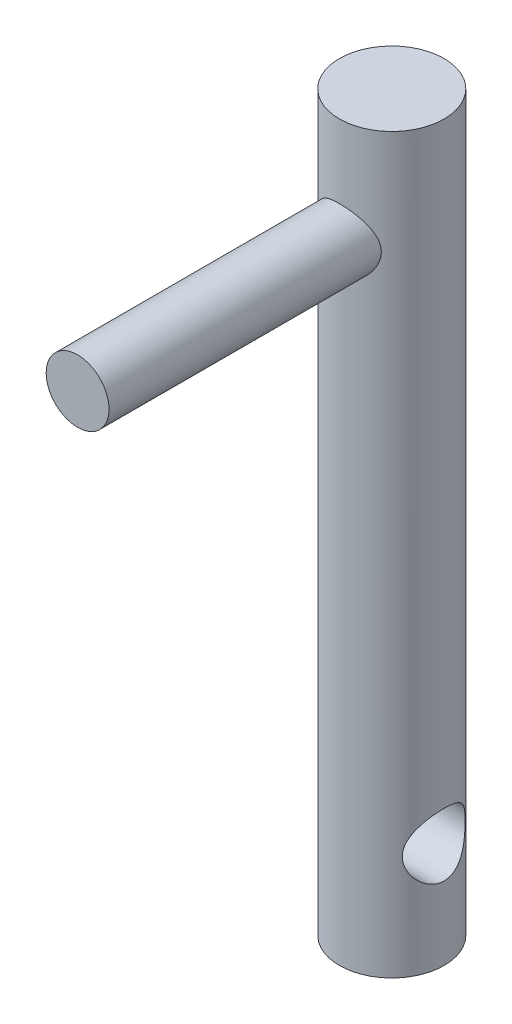
ISO-10303-21;
HEADER;
FILE_DESCRIPTION(('STEP AP214'),'2;1');
FILE_NAME('part.step','',(''),(''),'','','');
FILE_SCHEMA(('AUTOMOTIVE_DESIGN { 1 0 10303 214 1 1 1 1 }'));
ENDSEC;
DATA;
#1=APPLICATION_CONTEXT('core data for automotive mechanical design processes');
#2=APPLICATION_PROTOCOL_DEFINITION('international standard','automotive_design',2000,#1);
#3=PRODUCT_CONTEXT('',#1,'mechanical');
#4=PRODUCT('Part','Part','',(#3));
#5=PRODUCT_RELATED_PRODUCT_CATEGORY('part','',(#4));
#6=PRODUCT_DEFINITION_FORMATION('','',#4);
#7=PRODUCT_DEFINITION_CONTEXT('part definition',#1,'design');
#8=PRODUCT_DEFINITION('design','',#6,#7);
#9=PRODUCT_DEFINITION_SHAPE('','',#8);
#10=(LENGTH_UNIT() NAMED_UNIT(*) SI_UNIT(.MILLI.,.METRE.));
#11=(NAMED_UNIT(*) PLANE_ANGLE_UNIT() SI_UNIT($,.RADIAN.));
#12=(NAMED_UNIT(*) SI_UNIT($,.STERADIAN.) SOLID_ANGLE_UNIT());
#13=UNCERTAINTY_MEASURE_WITH_UNIT(LENGTH_MEASURE(1.E-05),#10,'distance_accuracy_value','');
#14=(GEOMETRIC_REPRESENTATION_CONTEXT(3) GLOBAL_UNCERTAINTY_ASSIGNED_CONTEXT((#13)) GLOBAL_UNIT_ASSIGNED_CONTEXT((#10,
#11,#12)) REPRESENTATION_CONTEXT('',''));
#15=CARTESIAN_POINT('',(0.,0.,0.));
#16=DIRECTION('',(0.,0.,1.));
#17=DIRECTION('',(1.,0.,0.));
#18=AXIS2_PLACEMENT_3D('',#15,#16,#17);
#19=CARTESIAN_POINT('',(0.,35.,0.));
#20=DIRECTION('',(0.,-1.,0.));
#21=DIRECTION('',(0.,0.,-1.));
#22=AXIS2_PLACEMENT_3D('',#19,#20,#21);
#23=CYLINDRICAL_SURFACE('',#22,2.5);
#24=CARTESIAN_POINT('',(-2.5,3.5,0.));
#25=CARTESIAN_POINT('',(-2.49999625789732,3.50000409100988,-0.0767298334620158));
#26=CARTESIAN_POINT('',(-2.4964290461501,3.50592867092626,-0.153582320644178));
#27=CARTESIAN_POINT('',(-2.48249903608568,3.52932431951533,-0.304975509530679));
#28=CARTESIAN_POINT('',(-2.47211948032719,3.54682386185422,-0.379510034596047));
#29=CARTESIAN_POINT('',(-2.44561558054488,3.59238636116686,-0.523751827790837));
#30=CARTESIAN_POINT('',(-2.42951973272944,3.62039695816316,-0.593481028226566));
#31=CARTESIAN_POINT('',(-2.39295367626407,3.68586033314103,-0.727030318214659));
#32=CARTESIAN_POINT('',(-2.37248455380255,3.72331076696875,-0.790851869416383));
#33=CARTESIAN_POINT('',(-2.32705360719088,3.80977482670858,-0.916299278999315));
#34=CARTESIAN_POINT('',(-2.30186792195985,3.85945369535139,-0.977384020081415));
#35=CARTESIAN_POINT('',(-2.25030439279634,3.96746720382827,-1.09088270411891));
#36=CARTESIAN_POINT('',(-2.22392505153571,4.02581293718732,-1.14328534948112));
#37=CARTESIAN_POINT('',(-2.1691106699591,4.15792351049673,-1.24444996762974));
#38=CARTESIAN_POINT('',(-2.14082017703649,4.23270177098129,-1.29197766378809));
#39=CARTESIAN_POINT('',(-2.08938301412124,4.39084657324312,-1.37361437764896));
#40=CARTESIAN_POINT('',(-2.06622802273938,4.47419889624757,-1.4077451733516));
#41=CARTESIAN_POINT('',(-2.0335462966093,4.62659645065324,-1.45440601714222));
#42=CARTESIAN_POINT('',(-2.02207883137591,4.69423599861032,-1.47016197246826));
#43=CARTESIAN_POINT('',(-2.00590308295503,4.83180371583036,-1.49216172340475));
#44=CARTESIAN_POINT('',(-2.00118639643759,4.90172892875449,-1.49841734556836));
#45=CARTESIAN_POINT('',(-1.99920922463856,5.04201149421734,-1.50105508796009));
#46=CARTESIAN_POINT('',(-2.00196337012718,5.1123694250932,-1.49741783408419));
#47=CARTESIAN_POINT('',(-2.01453261443741,5.25127877542759,-1.48046060478828));
#48=CARTESIAN_POINT('',(-2.02435302432226,5.31982879584745,-1.46713334620103));
#49=CARTESIAN_POINT('',(-2.04953186944258,5.45253024212811,-1.43173921881792));
#50=CARTESIAN_POINT('',(-2.06481711652537,5.51672705392448,-1.40978748666087));
#51=CARTESIAN_POINT('',(-2.09927051350828,5.64069499092812,-1.35795061770837));
#52=CARTESIAN_POINT('',(-2.11844008623465,5.70046448342393,-1.32806257259705));
#53=CARTESIAN_POINT('',(-2.16255327268985,5.8249840971228,-1.25517983184583));
#54=CARTESIAN_POINT('',(-2.18792043372992,5.88877809295493,-1.21080724397723));
#55=CARTESIAN_POINT('',(-2.23930599764381,6.00867648366702,-1.11291092784003));
#56=CARTESIAN_POINT('',(-2.26532500262149,6.06477343397651,-1.05937845100579));
#57=CARTESIAN_POINT('',(-2.31935504958317,6.17561298182176,-0.935811834382965));
#58=CARTESIAN_POINT('',(-2.34713836268532,6.22907730601599,-0.864517682704956));
#59=CARTESIAN_POINT('',(-2.39772428433981,6.32312204719791,-0.712276050458999));
#60=CARTESIAN_POINT('',(-2.42052955425515,6.36370935378995,-0.631333763943563));
#61=CARTESIAN_POINT('',(-2.45730392066151,6.4279321827959,-0.467197585268205));
#62=CARTESIAN_POINT('',(-2.47173957439704,6.45247535571591,-0.384467624173579));
#63=CARTESIAN_POINT('',(-2.49218842813551,6.48701119740538,-0.215047895144638));
#64=CARTESIAN_POINT('',(-2.49821172952738,6.49702131775358,-0.128363005661318));
#65=CARTESIAN_POINT('',(-2.5009057037461,6.50150784767831,0.0337146143773968));
#66=CARTESIAN_POINT('',(-2.49873521714286,6.49790885508517,0.109042473418718));
#67=CARTESIAN_POINT('',(-2.48778712087048,6.47957414692808,0.257829401986061));
#68=CARTESIAN_POINT('',(-2.47900964518037,6.46483865719419,0.331288509376106));
#69=CARTESIAN_POINT('',(-2.4559479244219,6.42545656718754,0.472574932157613));
#70=CARTESIAN_POINT('',(-2.44180275662555,6.40105965092653,0.540495750928484));
#71=CARTESIAN_POINT('',(-2.40913880862844,6.34332262363473,0.671265749087263));
#72=CARTESIAN_POINT('',(-2.39061916586511,6.30998074865333,0.734113924963909));
#73=CARTESIAN_POINT('',(-2.3484549623736,6.23144302079129,0.860006262823864));
#74=CARTESIAN_POINT('',(-2.3244780273988,6.18537617092161,0.922394150456837));
#75=CARTESIAN_POINT('',(-2.27474265574732,6.08460860651138,1.03902603131014));
#76=CARTESIAN_POINT('',(-2.2489821658636,6.02989784514746,1.09326040273738));
#77=CARTESIAN_POINT('',(-2.19445423909891,5.90508960996285,1.19931996735579));
#78=CARTESIAN_POINT('',(-2.16573241746291,5.8339161145345,1.24991019630915));
#79=CARTESIAN_POINT('',(-2.1121618206671,5.68278397543179,1.33845238915668));
#80=CARTESIAN_POINT('',(-2.0873089799769,5.60283470610721,1.37641766769781));
#81=CARTESIAN_POINT('',(-2.04984909240519,5.45375697769331,1.43142578795776));
#82=CARTESIAN_POINT('',(-2.03575659328729,5.38601968764141,1.4512162533619));
#83=CARTESIAN_POINT('',(-2.01409605743544,5.2474679219199,1.48113663905972));
#84=CARTESIAN_POINT('',(-2.00651897642721,5.17665785567217,1.49127995297631));
#85=CARTESIAN_POINT('',(-1.99900446616268,5.03362305240297,1.50134130416631));
#86=CARTESIAN_POINT('',(-1.99909576445937,4.96139400931296,1.50122089107869));
#87=CARTESIAN_POINT('',(-2.0069771789285,4.81810556439054,1.49066472959328));
#88=CARTESIAN_POINT('',(-2.0147714813882,4.7470468199194,1.48022337215759));
#89=CARTESIAN_POINT('',(-2.0363318524298,4.61151158242781,1.45040174148913));
#90=CARTESIAN_POINT('',(-2.0497921180558,4.54688290569313,1.43147636845351));
#91=CARTESIAN_POINT('',(-2.08105501960151,4.42166274552578,1.38563242076993));
#92=CARTESIAN_POINT('',(-2.09885929040482,4.36107279303945,1.35871083588479));
#93=CARTESIAN_POINT('',(-2.14012990550917,4.23568014277922,1.29289245555732));
#94=CARTESIAN_POINT('',(-2.16404587582639,4.17165889614569,1.25279167675753));
#95=CARTESIAN_POINT('',(-2.21320127030768,4.05061992738271,1.16375698389084));
#96=CARTESIAN_POINT('',(-2.23844177205021,3.99360803784744,1.11481579607798));
#97=CARTESIAN_POINT('',(-2.29225690291476,3.87864905086833,1.00009777425734));
#98=CARTESIAN_POINT('',(-2.32070308663658,3.82206892510381,0.932876819313904));
#99=CARTESIAN_POINT('',(-2.37365428872367,3.72090214413669,0.788462434445588));
#100=CARTESIAN_POINT('',(-2.39815789310936,3.67631978801521,0.711265444501539));
#101=CARTESIAN_POINT('',(-2.43985578654394,3.60221419242626,0.551125230801453));
#102=CARTESIAN_POINT('',(-2.45725077479787,3.57227193507317,0.468430086957214));
#103=CARTESIAN_POINT('',(-2.48366273001246,3.52727530478903,0.297973306118807));
#104=CARTESIAN_POINT('',(-2.49271125871485,3.51216483214301,0.210232099648612));
#105=CARTESIAN_POINT('',(-2.49802001168187,3.50330254529134,0.101558096917536));
#106=CARTESIAN_POINT('',(-2.49876114656362,3.5020655826939,0.0812762590282773));
#107=CARTESIAN_POINT('',(-2.49975164517367,3.50041375362914,0.0406658206871126));
#108=CARTESIAN_POINT('',(-2.50000099184316,3.4999989156791,0.0203372186375696));
#109=CARTESIAN_POINT('',(-2.5,3.5,0.));
#110=B_SPLINE_CURVE_WITH_KNOTS('',3,(#24,#25,#26,#27,#28,#29,#30,#31,#32,#33,#34,#35,#36,#37,
#38,#39,#40,#41,#42,#43,#44,#45,#46,#47,#48,#49,#50,#51,#52,#53,#54,#55,#56,#57,#58,#59,#60,#61,
#62,#63,#64,#65,#66,#67,#68,#69,#70,#71,#72,#73,#74,#75,#76,#77,#78,#79,#80,#81,#82,#83,#84,#85,
#86,#87,#88,#89,#90,#91,#92,#93,#94,#95,#96,#97,#98,#99,#100,#101,#102,#103,#104,#105,#106,#107,
#108,#109),.UNSPECIFIED.,.T.,.F.,(4,2,2,2,2,2,2,2,2,2,2,2,2,2,2,2,2,2,2,2,2,2,2,2,2,2,2,2,2,2,2,
2,2,2,2,2,2,2,2,2,2,2,4),(0.,0.230102237548649,0.460772627520012,0.690308884600012,
0.919788197992275,1.16681590732473,1.41416257934801,1.69183813189807,1.96906040692092,
2.17933829855633,2.38935420916578,2.59978170870726,2.81036753273872,3.01823267593207,
3.22617409809868,3.47046995225163,3.71500044803674,3.99360957884691,4.27206939275324,
4.5329679069656,4.79355286918236,5.01875602722426,5.24395461863455,5.46367785689772,
5.68344445659025,5.92601365818362,6.16886690081836,6.44336762428009,6.71757792616456,
6.93257787314692,7.14727888733319,7.36278425777433,7.57840681155725,7.78364098331142,
7.98895251523035,8.22578610052286,8.46281544370208,8.73854311775519,9.01436946031985,
9.28175654462677,9.54812832184448,9.60911473335177,9.6701032602764),.UNSPECIFIED.);
#111=CARTESIAN_POINT('',(-2.5,3.5,0.));
#112=VERTEX_POINT('',#111);
#113=EDGE_CURVE('E43',#112,#112,#110,.T.);
#114=ORIENTED_EDGE('',*,*,#113,.T.);
#115=EDGE_LOOP('',(#114));
#116=FACE_BOUND('',#115,.T.);
#117=CARTESIAN_POINT('',(2.,5.,-1.5));
#118=CARTESIAN_POINT('',(1.99999416642511,4.92452102471036,-1.50000404108592));
#119=CARTESIAN_POINT('',(2.00433633903481,4.8490615659202,-1.49426852824014));
#120=CARTESIAN_POINT('',(2.02092590613883,4.70067609603778,-1.47174965152787));
#121=CARTESIAN_POINT('',(2.03318155043097,4.6277528126149,-1.45495475788936));
#122=CARTESIAN_POINT('',(2.0636233903473,4.48691635832272,-1.41143486335795));
#123=CARTESIAN_POINT('',(2.0817666618312,4.41897116196473,-1.3847815450315));
#124=CARTESIAN_POINT('',(2.12185904995836,4.28856254663208,-1.32252909283019));
#125=CARTESIAN_POINT('',(2.14380930122416,4.22610077030486,-1.28692729054693));
#126=CARTESIAN_POINT('',(2.19228594587542,4.10005098333592,-1.20271292747644));
#127=CARTESIAN_POINT('',(2.21904371037662,4.03725904287606,-1.15304179435289));
#128=CARTESIAN_POINT('',(2.27226229431061,3.92023523725825,-1.04426801309985));
#129=CARTESIAN_POINT('',(2.29872287517103,3.8660098483292,-0.985158296729614));
#130=CARTESIAN_POINT('',(2.35175567858734,3.7618661902903,-0.851442367411702));
#131=CARTESIAN_POINT('',(2.37803133577818,3.71304553633025,-0.775851995162549));
#132=CARTESIAN_POINT('',(2.42443786983179,3.62919027755557,-0.615654228271659));
#133=CARTESIAN_POINT('',(2.44457437988735,3.59414302587729,-0.531055196626331));
#134=CARTESIAN_POINT('',(2.4747098780044,3.54240407718735,-0.363771406742667));
#135=CARTESIAN_POINT('',(2.4854930393917,3.5242796390327,-0.281674698130916));
#136=CARTESIAN_POINT('',(2.49874939277545,3.50205719713688,-0.114970509382709));
#137=CARTESIAN_POINT('',(2.50123038813308,3.49794602199995,-0.030365462400154));
#138=CARTESIAN_POINT('',(2.49783372711539,3.50361374734246,0.127637283737309));
#139=CARTESIAN_POINT('',(2.49295437513726,3.51173352616931,0.201123832865634));
#140=CARTESIAN_POINT('',(2.47707997553857,3.53847979564811,0.345464269151767));
#141=CARTESIAN_POINT('',(2.46608447529309,3.55710706390715,0.416317961051201));
#142=CARTESIAN_POINT('',(2.43884907201719,3.60416556270378,0.554056780469079));
#143=CARTESIAN_POINT('',(2.42257910450824,3.632653061139,0.620916491037617));
#144=CARTESIAN_POINT('',(2.38609637638748,3.69838461622554,0.748988660115611));
#145=CARTESIAN_POINT('',(2.36588259201812,3.73563094705901,0.810199646208011));
#146=CARTESIAN_POINT('',(2.32037925976363,3.82283909280445,0.933074267143199));
#147=CARTESIAN_POINT('',(2.2947718295215,3.87378831173574,0.993918663198193));
#148=CARTESIAN_POINT('',(2.24255554245601,3.98440411786018,1.10671465909275));
#149=CARTESIAN_POINT('',(2.21594536703375,4.04408250347451,1.1586540130834));
#150=CARTESIAN_POINT('',(2.16111075123946,4.17865340616355,1.25824837767417));
#151=CARTESIAN_POINT('',(2.13305661385124,4.25450757653946,1.30470933188632));
#152=CARTESIAN_POINT('',(2.08250879557267,4.41470623163661,1.38397217194232));
#153=CARTESIAN_POINT('',(2.0600049029882,4.49903471612564,1.41679921962189));
#154=CARTESIAN_POINT('',(2.02895865196731,4.65239363189535,1.46077497064842));
#155=CARTESIAN_POINT('',(2.01833888618315,4.72004063229664,1.47527903312665));
#156=CARTESIAN_POINT('',(2.00392150777558,4.85737361029948,1.49480872755284));
#157=CARTESIAN_POINT('',(2.00011596115116,4.92705712048456,1.49984538302907));
#158=CARTESIAN_POINT('',(1.99988914321323,5.06655168243571,1.50014781114183));
#159=CARTESIAN_POINT('',(2.00347810223984,5.13636277721521,1.49540004697659));
#160=CARTESIAN_POINT('',(2.01751520788652,5.27398734374856,1.47640290574941));
#161=CARTESIAN_POINT('',(2.02796877613213,5.34179919224026,1.46214601830139));
#162=CARTESIAN_POINT('',(2.054317683331,5.47371457947979,1.42488312618657));
#163=CARTESIAN_POINT('',(2.07020622092812,5.53782263653223,1.40188805257362));
#164=CARTESIAN_POINT('',(2.10571539417587,5.66147771573018,1.34796261057072));
#165=CARTESIAN_POINT('',(2.12533743689999,5.721023006366,1.31702924888212));
#166=CARTESIAN_POINT('',(2.17036819177737,5.84524008251225,1.24167439558512));
#167=CARTESIAN_POINT('',(2.19618239397369,5.90890083509657,1.19582663060303));
#168=CARTESIAN_POINT('',(2.2482175480362,6.02828548484946,1.09487395518701));
#169=CARTESIAN_POINT('',(2.27443886711455,6.08400169216912,1.03976018672402));
#170=CARTESIAN_POINT('',(2.32835625910913,6.19322400735043,0.913274837212767));
#171=CARTESIAN_POINT('',(2.3558007587587,6.24550072660584,0.840721108780192));
#172=CARTESIAN_POINT('',(2.40537639133459,6.33690277683665,0.68610310086802));
#173=CARTESIAN_POINT('',(2.42751104449411,6.37603682784092,0.604045176134703));
#174=CARTESIAN_POINT('',(2.46252280092775,6.43686820343137,0.438840232972138));
#175=CARTESIAN_POINT('',(2.47595588067329,6.45962622779111,0.356205963651258));
#176=CARTESIAN_POINT('',(2.494407389061,6.49071460284626,0.187383063890857));
#177=CARTESIAN_POINT('',(2.49943534582737,6.49906129071762,0.101198571781968));
#178=CARTESIAN_POINT('',(2.50040600461976,6.50067460858593,-0.0598120232009845));
#179=CARTESIAN_POINT('',(2.49747057186327,6.49580333456303,-0.134620583589707));
#180=CARTESIAN_POINT('',(2.48512948412095,6.47510617561839,-0.282148755978774));
#181=CARTESIAN_POINT('',(2.47572375706639,6.4592801686784,-0.354868344701914));
#182=CARTESIAN_POINT('',(2.45149427526962,6.41778042841621,-0.495145481978797));
#183=CARTESIAN_POINT('',(2.43675966858906,6.39226840387076,-0.562767032608831));
#184=CARTESIAN_POINT('',(2.40303337447155,6.33235940544525,-0.692781971999984));
#185=CARTESIAN_POINT('',(2.38404073252268,6.2979604391404,-0.755174184199833));
#186=CARTESIAN_POINT('',(2.34093432659381,6.21707480343124,-0.880263645295948));
#187=CARTESIAN_POINT('',(2.31648844639149,6.16968129098313,-0.94225869043994));
#188=CARTESIAN_POINT('',(2.26601907350661,6.06624696628228,-1.05789751536307));
#189=CARTESIAN_POINT('',(2.23999385274509,6.01019657439209,-1.11153190956916));
#190=CARTESIAN_POINT('',(2.18528165666204,5.8827144378223,-1.2159097535057));
#191=CARTESIAN_POINT('',(2.15667566270901,5.8102335138345,-1.26542406663368));
#192=CARTESIAN_POINT('',(2.10376464485145,5.65651514723346,-1.35156817210325));
#193=CARTESIAN_POINT('',(2.07945738811052,5.57528228601859,-1.38820466322661));
#194=CARTESIAN_POINT('',(2.0408000304796,5.4129357148628,-1.44437116535132));
#195=CARTESIAN_POINT('',(2.02577665830138,5.33240476403875,-1.46509526060187));
#196=CARTESIAN_POINT('',(2.00539032320036,5.16790260529632,-1.49289268240426));
#197=CARTESIAN_POINT('',(2.00000648744643,5.08393923424129,-1.49999550595837));
#198=CARTESIAN_POINT('',(2.,5.,-1.5));
#199=B_SPLINE_CURVE_WITH_KNOTS('',3,(#117,#118,#119,#120,#121,#122,#123,#124,#125,#126,#127,
#128,#129,#130,#131,#132,#133,#134,#135,#136,#137,#138,#139,#140,#141,#142,#143,#144,#145,#146,
#147,#148,#149,#150,#151,#152,#153,#154,#155,#156,#157,#158,#159,#160,#161,#162,#163,#164,#165,
#166,#167,#168,#169,#170,#171,#172,#173,#174,#175,#176,#177,#178,#179,#180,#181,#182,#183,#184,
#185,#186,#187,#188,#189,#190,#191,#192,#193,#194,#195,#196,#197,#198),.UNSPECIFIED.,.T.,.F.,(4,
2,2,2,2,2,2,2,2,2,2,2,2,2,2,2,2,2,2,2,2,2,2,2,2,2,2,2,2,2,2,2,2,2,2,2,2,2,2,2,4),(0.,
0.226085249493392,0.45240657433077,0.677113624991875,0.901887762215931,1.15414462390001,
1.40659128601844,1.68630157736223,1.9657544327122,2.21853330858497,2.47107452602766,
2.69230130543181,2.91354445887944,3.13607155036377,3.35865648368878,3.60782810055849,
3.85733966656908,4.13576671140276,4.41367760154768,4.62276298054684,4.83160475643976,
5.04073566011181,5.25003193304128,5.45906724365495,5.66818149154661,5.91499438482002,
6.16204457978454,6.44121828011588,6.72020638384847,6.97891479383337,7.23732973022726,
7.46129321849399,7.68525920139648,7.90563970188756,8.12606965394584,8.37042963549487,
8.61506198741955,8.89071695766604,9.16622832484805,9.41820120134354,9.66962780912277),.UNSPECIFIED.);
#200=CARTESIAN_POINT('',(2.,5.,-1.5));
#201=VERTEX_POINT('',#200);
#202=EDGE_CURVE('E47',#201,#201,#199,.T.);
#203=ORIENTED_EDGE('',*,*,#202,.T.);
#204=EDGE_LOOP('',(#203));
#205=FACE_BOUND('',#204,.T.);
#206=CARTESIAN_POINT('',(0.,35.,0.));
#207=DIRECTION('',(0.,1.,0.));
#208=DIRECTION('',(0.,0.,1.));
#209=AXIS2_PLACEMENT_3D('',#206,#207,#208);
#210=CIRCLE('',#209,2.5);
#211=CARTESIAN_POINT('',(0.,35.,2.5));
#212=VERTEX_POINT('',#211);
#213=EDGE_CURVE('E51',#212,#212,#210,.T.);
#214=ORIENTED_EDGE('',*,*,#213,.F.);
#215=EDGE_LOOP('',(#214));
#216=FACE_BOUND('',#215,.T.);
#217=CARTESIAN_POINT('',(0.,0.,0.));
#218=DIRECTION('',(0.,1.,0.));
#219=DIRECTION('',(0.,0.,1.));
#220=AXIS2_PLACEMENT_3D('',#217,#218,#219);
#221=CIRCLE('',#220,2.5);
#222=CARTESIAN_POINT('',(0.,0.,2.5));
#223=VERTEX_POINT('',#222);
#224=EDGE_CURVE('E90',#223,#223,#221,.T.);
#225=ORIENTED_EDGE('',*,*,#224,.T.);
#226=EDGE_LOOP('',(#225));
#227=FACE_BOUND('',#226,.T.);
#228=CARTESIAN_POINT('',(-1.5,30.,2.));
#229=CARTESIAN_POINT('',(-1.50000404108592,29.9245210247104,1.99999416642511));
#230=CARTESIAN_POINT('',(-1.49426852824014,29.8490615659202,2.00433633903481));
#231=CARTESIAN_POINT('',(-1.47174965152788,29.7006760960378,2.02092590613883));
#232=CARTESIAN_POINT('',(-1.45495475788936,29.6277528126149,2.03318155043097));
#233=CARTESIAN_POINT('',(-1.41143486335796,29.4869163583227,2.0636233903473));
#234=CARTESIAN_POINT('',(-1.3847815450315,29.4189711619647,2.08176666183119));
#235=CARTESIAN_POINT('',(-1.3225290928302,29.2885625466321,2.12185904995836));
#236=CARTESIAN_POINT('',(-1.28692729054694,29.2261007703049,2.14380930122416));
#237=CARTESIAN_POINT('',(-1.20271292747644,29.1000509833359,2.19228594587542));
#238=CARTESIAN_POINT('',(-1.15304179435289,29.0372590428761,2.21904371037662));
#239=CARTESIAN_POINT('',(-1.04426801309985,28.9202352372583,2.2722622943106));
#240=CARTESIAN_POINT('',(-0.985158296729614,28.8660098483292,2.29872287517103));
#241=CARTESIAN_POINT('',(-0.851442367411702,28.7618661902903,2.35175567858734));
#242=CARTESIAN_POINT('',(-0.775851995162549,28.7130455363302,2.37803133577818));
#243=CARTESIAN_POINT('',(-0.615654228271659,28.6291902775556,2.42443786983179));
#244=CARTESIAN_POINT('',(-0.53105519662633,28.5941430258773,2.44457437988735));
#245=CARTESIAN_POINT('',(-0.363771406742665,28.5424040771873,2.4747098780044));
#246=CARTESIAN_POINT('',(-0.281674698130914,28.5242796390327,2.4854930393917));
#247=CARTESIAN_POINT('',(-0.114970509382707,28.5020571971369,2.49874939277545));
#248=CARTESIAN_POINT('',(-0.0303654624001526,28.4979460219999,2.50123038813307));
#249=CARTESIAN_POINT('',(0.12763728373731,28.5036137473425,2.49783372711539));
#250=CARTESIAN_POINT('',(0.201123832865635,28.5117335261693,2.49295437513726));
#251=CARTESIAN_POINT('',(0.345464269151768,28.5384797956481,2.47707997553857));
#252=CARTESIAN_POINT('',(0.416317961051202,28.5571070639072,2.46608447529309));
#253=CARTESIAN_POINT('',(0.55405678046908,28.6041655627038,2.43884907201719));
#254=CARTESIAN_POINT('',(0.620916491037618,28.632653061139,2.42257910450824));
#255=CARTESIAN_POINT('',(0.748988660115612,28.6983846162255,2.38609637638748));
#256=CARTESIAN_POINT('',(0.810199646208012,28.735630947059,2.36588259201812));
#257=CARTESIAN_POINT('',(0.933074267143201,28.8228390928045,2.32037925976362));
#258=CARTESIAN_POINT('',(0.993918663198194,28.8737883117357,2.2947718295215));
#259=CARTESIAN_POINT('',(1.10671465909275,28.9844041178602,2.24255554245601));
#260=CARTESIAN_POINT('',(1.1586540130834,29.0440825034745,2.21594536703375));
#261=CARTESIAN_POINT('',(1.25824837767417,29.1786534061636,2.16111075123945));
#262=CARTESIAN_POINT('',(1.30470933188632,29.2545075765395,2.13305661385124));
#263=CARTESIAN_POINT('',(1.38397217194232,29.4147062316366,2.08250879557267));
#264=CARTESIAN_POINT('',(1.41679921962189,29.4990347161256,2.0600049029882));
#265=CARTESIAN_POINT('',(1.46077497064843,29.6523936318954,2.02895865196731));
#266=CARTESIAN_POINT('',(1.47527903312665,29.7200406322966,2.01833888618315));
#267=CARTESIAN_POINT('',(1.49480872755284,29.8573736102995,2.00392150777558));
#268=CARTESIAN_POINT('',(1.49984538302907,29.9270571204846,2.00011596115116));
#269=CARTESIAN_POINT('',(1.50014781114183,30.0665516824357,1.99988914321323));
#270=CARTESIAN_POINT('',(1.49540004697659,30.1363627772152,2.00347810223984));
#271=CARTESIAN_POINT('',(1.47640290574941,30.2739873437486,2.01751520788652));
#272=CARTESIAN_POINT('',(1.4621460183014,30.3417991922403,2.02796877613213));
#273=CARTESIAN_POINT('',(1.42488312618657,30.4737145794798,2.054317683331));
#274=CARTESIAN_POINT('',(1.40188805257362,30.5378226365322,2.07020622092812));
#275=CARTESIAN_POINT('',(1.34796261057072,30.6614777157302,2.10571539417587));
#276=CARTESIAN_POINT('',(1.31702924888212,30.721023006366,2.12533743689999));
#277=CARTESIAN_POINT('',(1.24167439558512,30.8452400825123,2.17036819177737));
#278=CARTESIAN_POINT('',(1.19582663060302,30.9089008350966,2.19618239397369));
#279=CARTESIAN_POINT('',(1.09487395518701,31.0282854848495,2.24821754803621));
#280=CARTESIAN_POINT('',(1.03976018672402,31.0840016921691,2.27443886711455));
#281=CARTESIAN_POINT('',(0.913274837212766,31.1932240073504,2.32835625910913));
#282=CARTESIAN_POINT('',(0.84072110878019,31.2455007266058,2.3558007587587));
#283=CARTESIAN_POINT('',(0.686103100868017,31.3369027768367,2.40537639133459));
#284=CARTESIAN_POINT('',(0.6040451761347,31.3760368278409,2.42751104449411));
#285=CARTESIAN_POINT('',(0.438840232972136,31.4368682034314,2.46252280092775));
#286=CARTESIAN_POINT('',(0.356205963651256,31.4596262277911,2.47595588067329));
#287=CARTESIAN_POINT('',(0.187383063890855,31.4907146028463,2.494407389061));
#288=CARTESIAN_POINT('',(0.101198571781966,31.4990612907176,2.49943534582737));
#289=CARTESIAN_POINT('',(-0.0598120232009864,31.5006746085859,2.50040600461976));
#290=CARTESIAN_POINT('',(-0.134620583589708,31.495803334563,2.49747057186327));
#291=CARTESIAN_POINT('',(-0.282148755978776,31.4751061756184,2.48512948412095));
#292=CARTESIAN_POINT('',(-0.354868344701917,31.4592801686784,2.47572375706639));
#293=CARTESIAN_POINT('',(-0.4951454819788,31.4177804284162,2.45149427526962));
#294=CARTESIAN_POINT('',(-0.562767032608834,31.3922684038708,2.43675966858906));
#295=CARTESIAN_POINT('',(-0.692781971999989,31.3323594054452,2.40303337447155));
#296=CARTESIAN_POINT('',(-0.755174184199837,31.2979604391404,2.38404073252268));
#297=CARTESIAN_POINT('',(-0.880263645295951,31.2170748034312,2.3409343265938));
#298=CARTESIAN_POINT('',(-0.942258690439942,31.1696812909831,2.31648844639149));
#299=CARTESIAN_POINT('',(-1.05789751536307,31.0662469662823,2.26601907350661));
#300=CARTESIAN_POINT('',(-1.11153190956916,31.0101965743921,2.23999385274509));
#301=CARTESIAN_POINT('',(-1.2159097535057,30.8827144378223,2.18528165666204));
#302=CARTESIAN_POINT('',(-1.26542406663368,30.8102335138345,2.15667566270901));
#303=CARTESIAN_POINT('',(-1.35156817210325,30.6565151472335,2.10376464485145));
#304=CARTESIAN_POINT('',(-1.38820466322661,30.5752822860186,2.07945738811052));
#305=CARTESIAN_POINT('',(-1.44437116535132,30.4129357148628,2.0408000304796));
#306=CARTESIAN_POINT('',(-1.46509526060188,30.3324047640388,2.02577665830138));
#307=CARTESIAN_POINT('',(-1.49289268240427,30.1679026052963,2.00539032320036));
#308=CARTESIAN_POINT('',(-1.49999550595837,30.0839392342413,2.00000648744643));
#309=CARTESIAN_POINT('',(-1.5,30.,2.));
#310=B_SPLINE_CURVE_WITH_KNOTS('',3,(#228,#229,#230,#231,#232,#233,#234,#235,#236,#237,#238,
#239,#240,#241,#242,#243,#244,#245,#246,#247,#248,#249,#250,#251,#252,#253,#254,#255,#256,#257,
#258,#259,#260,#261,#262,#263,#264,#265,#266,#267,#268,#269,#270,#271,#272,#273,#274,#275,#276,
#277,#278,#279,#280,#281,#282,#283,#284,#285,#286,#287,#288,#289,#290,#291,#292,#293,#294,#295,
#296,#297,#298,#299,#300,#301,#302,#303,#304,#305,#306,#307,#308,#309),.UNSPECIFIED.,.T.,.F.,(4,
2,2,2,2,2,2,2,2,2,2,2,2,2,2,2,2,2,2,2,2,2,2,2,2,2,2,2,2,2,2,2,2,2,2,2,2,2,2,2,4),(0.,
0.22608524949339,0.452406574330771,0.677113624991876,0.90188776221593,1.15414462390001,
1.40659128601844,1.68630157736223,1.9657544327122,2.21853330858498,2.47107452602767,
2.69230130543182,2.91354445887945,3.13607155036377,3.35865648368879,3.60782810055849,
3.85733966656909,4.13576671140277,4.41367760154769,4.62276298054685,4.83160475643977,
5.04073566011182,5.25003193304129,5.45906724365496,5.66818149154662,5.91499438482003,
6.16204457978455,6.4412182801159,6.72020638384849,6.97891479383338,7.23732973022727,
7.461293218494,7.68525920139649,7.90563970188757,8.12606965394586,8.37042963549488,
8.61506198741956,8.89071695766605,9.16622832484807,9.41820120134355,9.66962780912278),.UNSPECIFIED.);
#311=CARTESIAN_POINT('',(-1.5,30.,2.));
#312=VERTEX_POINT('',#311);
#313=EDGE_CURVE('E10',#312,#312,#310,.T.);
#314=ORIENTED_EDGE('',*,*,#313,.F.);
#315=EDGE_LOOP('',(#314));
#316=FACE_BOUND('',#315,.T.);
#317=ADVANCED_FACE('F32',(#116,#205,#216,#227,#316),#23,.T.);
#318=CARTESIAN_POINT('',(0.,35.,0.));
#319=DIRECTION('',(0.,1.,0.));
#320=DIRECTION('',(0.,0.,1.));
#321=AXIS2_PLACEMENT_3D('',#318,#319,#320);
#322=PLANE('',#321);
#323=ORIENTED_EDGE('',*,*,#213,.T.);
#324=EDGE_LOOP('',(#323));
#325=FACE_BOUND('',#324,.T.);
#326=ADVANCED_FACE('F70',(#325),#322,.T.);
#327=CARTESIAN_POINT('',(0.,0.,0.));
#328=DIRECTION('',(0.,1.,0.));
#329=DIRECTION('',(0.,0.,1.));
#330=AXIS2_PLACEMENT_3D('',#327,#328,#329);
#331=PLANE('',#330);
#332=ORIENTED_EDGE('',*,*,#224,.F.);
#333=EDGE_LOOP('',(#332));
#334=FACE_BOUND('',#333,.T.);
#335=ADVANCED_FACE('F66',(#334),#331,.F.);
#336=CARTESIAN_POINT('',(-2.5,5.,0.));
#337=DIRECTION('',(1.,0.,0.));
#338=DIRECTION('',(0.,0.,-1.));
#339=AXIS2_PLACEMENT_3D('',#336,#337,#338);
#340=CYLINDRICAL_SURFACE('',#339,1.5);
#341=ORIENTED_EDGE('',*,*,#202,.F.);
#342=EDGE_LOOP('',(#341));
#343=FACE_BOUND('',#342,.T.);
#344=ORIENTED_EDGE('',*,*,#113,.F.);
#345=EDGE_LOOP('',(#344));
#346=FACE_BOUND('',#345,.T.);
#347=ADVANCED_FACE('F61',(#343,#346),#340,.F.);
#348=CARTESIAN_POINT('',(0.,30.,15.));
#349=DIRECTION('',(0.,0.,-1.));
#350=DIRECTION('',(-1.,0.,0.));
#351=AXIS2_PLACEMENT_3D('',#348,#349,#350);
#352=CYLINDRICAL_SURFACE('',#351,1.5);
#353=CARTESIAN_POINT('',(0.,30.,15.));
#354=DIRECTION('',(0.,0.,1.));
#355=DIRECTION('',(1.,0.,0.));
#356=AXIS2_PLACEMENT_3D('',#353,#354,#355);
#357=CIRCLE('',#356,1.5);
#358=CARTESIAN_POINT('',(1.5,30.,15.));
#359=VERTEX_POINT('',#358);
#360=EDGE_CURVE('E91',#359,#359,#357,.T.);
#361=ORIENTED_EDGE('',*,*,#360,.F.);
#362=EDGE_LOOP('',(#361));
#363=FACE_BOUND('',#362,.T.);
#364=ORIENTED_EDGE('',*,*,#313,.T.);
#365=EDGE_LOOP('',(#364));
#366=FACE_BOUND('',#365,.T.);
#367=ADVANCED_FACE('F65',(#363,#366),#352,.T.);
#368=CARTESIAN_POINT('',(0.,30.,15.));
#369=DIRECTION('',(0.,0.,1.));
#370=DIRECTION('',(1.,0.,0.));
#371=AXIS2_PLACEMENT_3D('',#368,#369,#370);
#372=PLANE('',#371);
#373=ORIENTED_EDGE('',*,*,#360,.T.);
#374=EDGE_LOOP('',(#373));
#375=FACE_BOUND('',#374,.T.);
#376=ADVANCED_FACE('F97',(#375),#372,.T.);
#377=CLOSED_SHELL('',(#317,#326,#335,#347,#367,#376));
#378=MANIFOLD_SOLID_BREP('B2',#377);
#379=ADVANCED_BREP_SHAPE_REPRESENTATION('',(#18,#378),#14);
#380=SHAPE_DEFINITION_REPRESENTATION(#9,#379);
ENDSEC;
END-ISO-10303-21;
